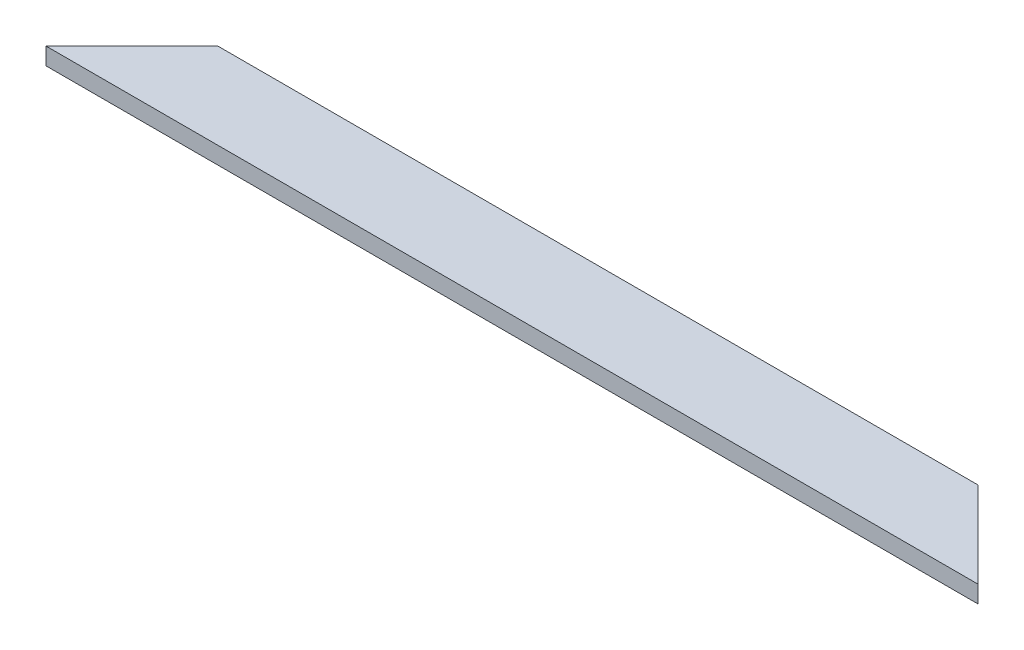
ISO-10303-21;
HEADER;
FILE_DESCRIPTION(('STEP AP214'),'2;1');
FILE_NAME('part.step','',(''),(''),'','','');
FILE_SCHEMA(('AUTOMOTIVE_DESIGN { 1 0 10303 214 1 1 1 1 }'));
ENDSEC;
DATA;
#1=APPLICATION_CONTEXT('core data for automotive mechanical design processes');
#2=APPLICATION_PROTOCOL_DEFINITION('international standard','automotive_design',2000,#1);
#3=PRODUCT_CONTEXT('',#1,'mechanical');
#4=PRODUCT('Part','Part','',(#3));
#5=PRODUCT_RELATED_PRODUCT_CATEGORY('part','',(#4));
#6=PRODUCT_DEFINITION_FORMATION('','',#4);
#7=PRODUCT_DEFINITION_CONTEXT('part definition',#1,'design');
#8=PRODUCT_DEFINITION('design','',#6,#7);
#9=PRODUCT_DEFINITION_SHAPE('','',#8);
#10=(LENGTH_UNIT() NAMED_UNIT(*) SI_UNIT(.MILLI.,.METRE.));
#11=(NAMED_UNIT(*) PLANE_ANGLE_UNIT() SI_UNIT($,.RADIAN.));
#12=(NAMED_UNIT(*) SI_UNIT($,.STERADIAN.) SOLID_ANGLE_UNIT());
#13=UNCERTAINTY_MEASURE_WITH_UNIT(LENGTH_MEASURE(1.E-05),#10,'distance_accuracy_value','');
#14=(GEOMETRIC_REPRESENTATION_CONTEXT(3) GLOBAL_UNCERTAINTY_ASSIGNED_CONTEXT((#13)) GLOBAL_UNIT_ASSIGNED_CONTEXT((#10,
#11,#12)) REPRESENTATION_CONTEXT('',''));
#15=CARTESIAN_POINT('',(0.,0.,0.));
#16=DIRECTION('',(0.,0.,1.));
#17=DIRECTION('',(1.,0.,0.));
#18=AXIS2_PLACEMENT_3D('',#15,#16,#17);
#19=CARTESIAN_POINT('',(217.,0.,0.));
#20=DIRECTION('',(0.,1.,0.));
#21=DIRECTION('',(0.,0.,1.));
#22=AXIS2_PLACEMENT_3D('',#19,#20,#21);
#23=PLANE('',#22);
#24=DIRECTION('',(-0.707106781186546,0.,0.707106781186549));
#25=VECTOR('',#24,1.);
#26=CARTESIAN_POINT('',(108.5,0.,-108.5));
#27=LINE('',#26,#25);
#28=CARTESIAN_POINT('',(19.9999999999999,0.,-20.));
#29=VERTEX_POINT('',#28);
#30=CARTESIAN_POINT('',(0.,0.,0.));
#31=VERTEX_POINT('',#30);
#32=EDGE_CURVE('E101',#29,#31,#27,.T.);
#33=ORIENTED_EDGE('',*,*,#32,.F.);
#34=DIRECTION('',(-1.,0.,0.));
#35=VECTOR('',#34,1.);
#36=CARTESIAN_POINT('',(217.,0.,-20.));
#37=LINE('',#36,#35);
#38=CARTESIAN_POINT('',(197.,0.,-20.));
#39=VERTEX_POINT('',#38);
#40=EDGE_CURVE('E44',#39,#29,#37,.T.);
#41=ORIENTED_EDGE('',*,*,#40,.F.);
#42=DIRECTION('',(-0.707106781186547,0.,-0.707106781186548));
#43=VECTOR('',#42,1.);
#44=CARTESIAN_POINT('',(217.,0.,0.));
#45=LINE('',#44,#43);
#46=CARTESIAN_POINT('',(217.,0.,0.));
#47=VERTEX_POINT('',#46);
#48=EDGE_CURVE('E73',#47,#39,#45,.T.);
#49=ORIENTED_EDGE('',*,*,#48,.F.);
#50=DIRECTION('',(-1.,0.,0.));
#51=VECTOR('',#50,1.);
#52=CARTESIAN_POINT('',(217.,0.,0.));
#53=LINE('',#52,#51);
#54=EDGE_CURVE('E12',#47,#31,#53,.T.);
#55=ORIENTED_EDGE('',*,*,#54,.T.);
#56=EDGE_LOOP('',(#33,#41,#49,#55));
#57=FACE_BOUND('',#56,.T.);
#58=ADVANCED_FACE('F35',(#57),#23,.F.);
#59=CARTESIAN_POINT('',(217.,0.,-20.));
#60=DIRECTION('',(0.,0.,1.));
#61=DIRECTION('',(1.,0.,0.));
#62=AXIS2_PLACEMENT_3D('',#59,#60,#61);
#63=PLANE('',#62);
#64=DIRECTION('',(0.,1.,0.));
#65=VECTOR('',#64,1.);
#66=CARTESIAN_POINT('',(19.9999999999999,-6.,-20.));
#67=LINE('',#66,#65);
#68=CARTESIAN_POINT('',(19.9999999999999,4.,-20.));
#69=VERTEX_POINT('',#68);
#70=EDGE_CURVE('E78',#29,#69,#67,.T.);
#71=ORIENTED_EDGE('',*,*,#70,.T.);
#72=DIRECTION('',(-1.,0.,0.));
#73=VECTOR('',#72,1.);
#74=CARTESIAN_POINT('',(217.,4.,-20.));
#75=LINE('',#74,#73);
#76=CARTESIAN_POINT('',(197.,4.,-20.));
#77=VERTEX_POINT('',#76);
#78=EDGE_CURVE('E85',#77,#69,#75,.T.);
#79=ORIENTED_EDGE('',*,*,#78,.F.);
#80=DIRECTION('',(0.,1.,0.));
#81=VECTOR('',#80,1.);
#82=CARTESIAN_POINT('',(197.,-6.,-20.));
#83=LINE('',#82,#81);
#84=EDGE_CURVE('E70',#39,#77,#83,.T.);
#85=ORIENTED_EDGE('',*,*,#84,.F.);
#86=ORIENTED_EDGE('',*,*,#40,.T.);
#87=EDGE_LOOP('',(#71,#79,#85,#86));
#88=FACE_BOUND('',#87,.T.);
#89=ADVANCED_FACE('F91',(#88),#63,.F.);
#90=CARTESIAN_POINT('',(217.,4.,0.));
#91=DIRECTION('',(0.,-1.,0.));
#92=DIRECTION('',(0.,0.,-1.));
#93=AXIS2_PLACEMENT_3D('',#90,#91,#92);
#94=PLANE('',#93);
#95=DIRECTION('',(-0.707106781186546,0.,0.707106781186549));
#96=VECTOR('',#95,1.);
#97=CARTESIAN_POINT('',(0.,4.,0.));
#98=LINE('',#97,#96);
#99=CARTESIAN_POINT('',(0.,4.,0.));
#100=VERTEX_POINT('',#99);
#101=EDGE_CURVE('E79',#69,#100,#98,.T.);
#102=ORIENTED_EDGE('',*,*,#101,.T.);
#103=DIRECTION('',(-1.,0.,0.));
#104=VECTOR('',#103,1.);
#105=CARTESIAN_POINT('',(217.,4.,0.));
#106=LINE('',#105,#104);
#107=CARTESIAN_POINT('',(217.,4.,0.));
#108=VERTEX_POINT('',#107);
#109=EDGE_CURVE('E87',#108,#100,#106,.T.);
#110=ORIENTED_EDGE('',*,*,#109,.F.);
#111=DIRECTION('',(-0.707106781186547,0.,-0.707106781186548));
#112=VECTOR('',#111,1.);
#113=CARTESIAN_POINT('',(197.,4.,-20.));
#114=LINE('',#113,#112);
#115=EDGE_CURVE('E50',#108,#77,#114,.T.);
#116=ORIENTED_EDGE('',*,*,#115,.T.);
#117=ORIENTED_EDGE('',*,*,#78,.T.);
#118=EDGE_LOOP('',(#102,#110,#116,#117));
#119=FACE_BOUND('',#118,.T.);
#120=ADVANCED_FACE('F84',(#119),#94,.F.);
#121=CARTESIAN_POINT('',(217.,0.,0.));
#122=DIRECTION('',(0.,0.,-1.));
#123=DIRECTION('',(-1.,0.,0.));
#124=AXIS2_PLACEMENT_3D('',#121,#122,#123);
#125=PLANE('',#124);
#126=DIRECTION('',(0.,-1.,0.));
#127=VECTOR('',#126,1.);
#128=CARTESIAN_POINT('',(0.,0.,0.));
#129=LINE('',#128,#127);
#130=EDGE_CURVE('E96',#100,#31,#129,.T.);
#131=ORIENTED_EDGE('',*,*,#130,.T.);
#132=ORIENTED_EDGE('',*,*,#54,.F.);
#133=DIRECTION('',(0.,-1.,0.));
#134=VECTOR('',#133,1.);
#135=CARTESIAN_POINT('',(217.,0.,0.));
#136=LINE('',#135,#134);
#137=EDGE_CURVE('E93',#108,#47,#136,.T.);
#138=ORIENTED_EDGE('',*,*,#137,.F.);
#139=ORIENTED_EDGE('',*,*,#109,.T.);
#140=EDGE_LOOP('',(#131,#132,#138,#139));
#141=FACE_BOUND('',#140,.T.);
#142=ADVANCED_FACE('F37',(#141),#125,.F.);
#143=CARTESIAN_POINT('',(0.,-6.,0.));
#144=DIRECTION('',(-0.707106781186549,0.,-0.707106781186546));
#145=DIRECTION('',(-0.707106781186546,0.,0.707106781186549));
#146=AXIS2_PLACEMENT_3D('',#143,#144,#145);
#147=PLANE('',#146);
#148=ORIENTED_EDGE('',*,*,#32,.T.);
#149=ORIENTED_EDGE('',*,*,#130,.F.);
#150=ORIENTED_EDGE('',*,*,#101,.F.);
#151=ORIENTED_EDGE('',*,*,#70,.F.);
#152=EDGE_LOOP('',(#148,#149,#150,#151));
#153=FACE_BOUND('',#152,.T.);
#154=ADVANCED_FACE('F109',(#153),#147,.T.);
#155=CARTESIAN_POINT('',(197.,-6.,-20.));
#156=DIRECTION('',(0.707106781186548,0.,-0.707106781186547));
#157=DIRECTION('',(-0.707106781186547,0.,-0.707106781186548));
#158=AXIS2_PLACEMENT_3D('',#155,#156,#157);
#159=PLANE('',#158);
#160=ORIENTED_EDGE('',*,*,#48,.T.);
#161=ORIENTED_EDGE('',*,*,#84,.T.);
#162=ORIENTED_EDGE('',*,*,#115,.F.);
#163=ORIENTED_EDGE('',*,*,#137,.T.);
#164=EDGE_LOOP('',(#160,#161,#162,#163));
#165=FACE_BOUND('',#164,.T.);
#166=ADVANCED_FACE('F71',(#165),#159,.T.);
#167=CLOSED_SHELL('',(#58,#89,#120,#142,#154,#166));
#168=MANIFOLD_SOLID_BREP('B2',#167);
#169=ADVANCED_BREP_SHAPE_REPRESENTATION('',(#18,#168),#14);
#170=SHAPE_DEFINITION_REPRESENTATION(#9,#169);
ENDSEC;
END-ISO-10303-21;
